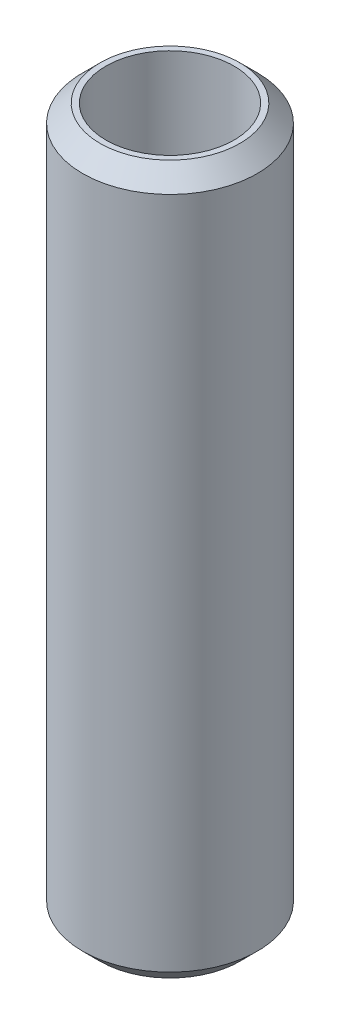
ISO-10303-21;
HEADER;
FILE_DESCRIPTION(('STEP AP214'),'2;1');
FILE_NAME('part.step','',(''),(''),'','','');
FILE_SCHEMA(('AUTOMOTIVE_DESIGN { 1 0 10303 214 1 1 1 1 }'));
ENDSEC;
DATA;
#1=APPLICATION_CONTEXT('core data for automotive mechanical design processes');
#2=APPLICATION_PROTOCOL_DEFINITION('international standard','automotive_design',2000,#1);
#3=PRODUCT_CONTEXT('',#1,'mechanical');
#4=PRODUCT('Part','Part','',(#3));
#5=PRODUCT_RELATED_PRODUCT_CATEGORY('part','',(#4));
#6=PRODUCT_DEFINITION_FORMATION('','',#4);
#7=PRODUCT_DEFINITION_CONTEXT('part definition',#1,'design');
#8=PRODUCT_DEFINITION('design','',#6,#7);
#9=PRODUCT_DEFINITION_SHAPE('','',#8);
#10=(LENGTH_UNIT() NAMED_UNIT(*) SI_UNIT(.MILLI.,.METRE.));
#11=(NAMED_UNIT(*) PLANE_ANGLE_UNIT() SI_UNIT($,.RADIAN.));
#12=(NAMED_UNIT(*) SI_UNIT($,.STERADIAN.) SOLID_ANGLE_UNIT());
#13=UNCERTAINTY_MEASURE_WITH_UNIT(LENGTH_MEASURE(1.E-05),#10,'distance_accuracy_value','');
#14=(GEOMETRIC_REPRESENTATION_CONTEXT(3) GLOBAL_UNCERTAINTY_ASSIGNED_CONTEXT((#13)) GLOBAL_UNIT_ASSIGNED_CONTEXT((#10,
#11,#12)) REPRESENTATION_CONTEXT('',''));
#15=CARTESIAN_POINT('',(0.,0.,0.));
#16=DIRECTION('',(0.,0.,1.));
#17=DIRECTION('',(1.,0.,0.));
#18=AXIS2_PLACEMENT_3D('',#15,#16,#17);
#19=CARTESIAN_POINT('',(0.,202.788033825305,0.));
#20=DIRECTION('',(0.,-1.,0.));
#21=DIRECTION('',(0.,0.,-1.));
#22=AXIS2_PLACEMENT_3D('',#19,#20,#21);
#23=CYLINDRICAL_SURFACE('',#22,25.);
#24=CARTESIAN_POINT('',(0.,197.804832912559,0.));
#25=DIRECTION('',(0.,1.,0.));
#26=DIRECTION('',(0.,0.,1.));
#27=AXIS2_PLACEMENT_3D('',#24,#25,#26);
#28=CIRCLE('',#27,25.);
#29=CARTESIAN_POINT('',(0.,197.804832912559,25.));
#30=VERTEX_POINT('',#29);
#31=EDGE_CURVE('E50',#30,#30,#28,.F.);
#32=ORIENTED_EDGE('',*,*,#31,.T.);
#33=EDGE_LOOP('',(#32));
#34=FACE_BOUND('',#33,.T.);
#35=CARTESIAN_POINT('',(0.,4.98320091274596,0.));
#36=DIRECTION('',(0.,1.,0.));
#37=DIRECTION('',(0.,0.,1.));
#38=AXIS2_PLACEMENT_3D('',#35,#36,#37);
#39=CIRCLE('',#38,25.);
#40=CARTESIAN_POINT('',(0.,4.98320091274596,25.));
#41=VERTEX_POINT('',#40);
#42=EDGE_CURVE('E51',#41,#41,#39,.T.);
#43=ORIENTED_EDGE('',*,*,#42,.T.);
#44=EDGE_LOOP('',(#43));
#45=FACE_BOUND('',#44,.T.);
#46=ADVANCED_FACE('F39',(#34,#45),#23,.T.);
#47=CARTESIAN_POINT('',(0.,202.788033825305,0.));
#48=DIRECTION('',(0.,1.,0.));
#49=DIRECTION('',(0.,0.,1.));
#50=AXIS2_PLACEMENT_3D('',#47,#48,#49);
#51=PLANE('',#50);
#52=CARTESIAN_POINT('',(0.,202.788033825305,0.));
#53=DIRECTION('',(0.,1.,0.));
#54=DIRECTION('',(0.,0.,1.));
#55=AXIS2_PLACEMENT_3D('',#52,#53,#54);
#56=CIRCLE('',#55,20.0167990872541);
#57=CARTESIAN_POINT('',(0.,202.788033825305,20.0167990872541));
#58=VERTEX_POINT('',#57);
#59=EDGE_CURVE('E54',#58,#58,#56,.T.);
#60=ORIENTED_EDGE('',*,*,#59,.T.);
#61=EDGE_LOOP('',(#60));
#62=FACE_BOUND('',#61,.T.);
#63=CARTESIAN_POINT('',(0.,202.788033825305,0.));
#64=DIRECTION('',(0.,1.,0.));
#65=DIRECTION('',(0.,0.,1.));
#66=AXIS2_PLACEMENT_3D('',#63,#64,#65);
#67=CIRCLE('',#66,18.3605221500301);
#68=CARTESIAN_POINT('',(0.,202.788033825305,18.3605221500301));
#69=VERTEX_POINT('',#68);
#70=EDGE_CURVE('E58',#69,#69,#67,.T.);
#71=ORIENTED_EDGE('',*,*,#70,.F.);
#72=EDGE_LOOP('',(#71));
#73=FACE_BOUND('',#72,.T.);
#74=ADVANCED_FACE('F69',(#62,#73),#51,.T.);
#75=CARTESIAN_POINT('',(0.,0.,0.));
#76=DIRECTION('',(0.,1.,0.));
#77=DIRECTION('',(0.,0.,1.));
#78=AXIS2_PLACEMENT_3D('',#75,#76,#77);
#79=PLANE('',#78);
#80=CARTESIAN_POINT('',(0.,0.,0.));
#81=DIRECTION('',(0.,1.,0.));
#82=DIRECTION('',(0.,0.,1.));
#83=AXIS2_PLACEMENT_3D('',#80,#81,#82);
#84=CIRCLE('',#83,20.016799087254);
#85=CARTESIAN_POINT('',(0.,0.,20.016799087254));
#86=VERTEX_POINT('',#85);
#87=EDGE_CURVE('E10',#86,#86,#84,.F.);
#88=ORIENTED_EDGE('',*,*,#87,.T.);
#89=EDGE_LOOP('',(#88));
#90=FACE_BOUND('',#89,.T.);
#91=CARTESIAN_POINT('',(0.,0.,0.));
#92=DIRECTION('',(0.,1.,0.));
#93=DIRECTION('',(0.,0.,1.));
#94=AXIS2_PLACEMENT_3D('',#91,#92,#93);
#95=CIRCLE('',#94,18.3605221500301);
#96=CARTESIAN_POINT('',(0.,0.,18.3605221500301));
#97=VERTEX_POINT('',#96);
#98=EDGE_CURVE('E63',#97,#97,#95,.T.);
#99=ORIENTED_EDGE('',*,*,#98,.T.);
#100=EDGE_LOOP('',(#99));
#101=FACE_BOUND('',#100,.T.);
#102=ADVANCED_FACE('F75',(#90,#101),#79,.F.);
#103=CARTESIAN_POINT('',(0.,202.788033825305,0.));
#104=DIRECTION('',(0.,-1.,0.));
#105=DIRECTION('',(0.,0.,-1.));
#106=AXIS2_PLACEMENT_3D('',#103,#104,#105);
#107=CYLINDRICAL_SURFACE('',#106,18.3605221500301);
#108=ORIENTED_EDGE('',*,*,#70,.T.);
#109=EDGE_LOOP('',(#108));
#110=FACE_BOUND('',#109,.T.);
#111=ORIENTED_EDGE('',*,*,#98,.F.);
#112=EDGE_LOOP('',(#111));
#113=FACE_BOUND('',#112,.T.);
#114=ADVANCED_FACE('F70',(#110,#113),#107,.F.);
#115=CARTESIAN_POINT('',(0.,202.788033825305,0.));
#116=DIRECTION('',(0.,-1.,0.));
#117=DIRECTION('',(0.,0.,-1.));
#118=AXIS2_PLACEMENT_3D('',#115,#116,#117);
#119=CONICAL_SURFACE('',#118,20.0167990872541,0.785398163397447);
#120=ORIENTED_EDGE('',*,*,#31,.F.);
#121=EDGE_LOOP('',(#120));
#122=FACE_BOUND('',#121,.T.);
#123=ORIENTED_EDGE('',*,*,#59,.F.);
#124=EDGE_LOOP('',(#123));
#125=FACE_BOUND('',#124,.T.);
#126=ADVANCED_FACE('F81',(#122,#125),#119,.T.);
#127=CARTESIAN_POINT('',(0.,4.98320091274596,0.));
#128=DIRECTION('',(0.,1.,0.));
#129=DIRECTION('',(0.,0.,1.));
#130=AXIS2_PLACEMENT_3D('',#127,#128,#129);
#131=CONICAL_SURFACE('',#130,25.,0.785398163397451);
#132=ORIENTED_EDGE('',*,*,#87,.F.);
#133=EDGE_LOOP('',(#132));
#134=FACE_BOUND('',#133,.T.);
#135=ORIENTED_EDGE('',*,*,#42,.F.);
#136=EDGE_LOOP('',(#135));
#137=FACE_BOUND('',#136,.T.);
#138=ADVANCED_FACE('F45',(#134,#137),#131,.T.);
#139=CLOSED_SHELL('',(#46,#74,#102,#114,#126,#138));
#140=MANIFOLD_SOLID_BREP('B2',#139);
#141=ADVANCED_BREP_SHAPE_REPRESENTATION('',(#18,#140),#14);
#142=SHAPE_DEFINITION_REPRESENTATION(#9,#141);
ENDSEC;
END-ISO-10303-21;
